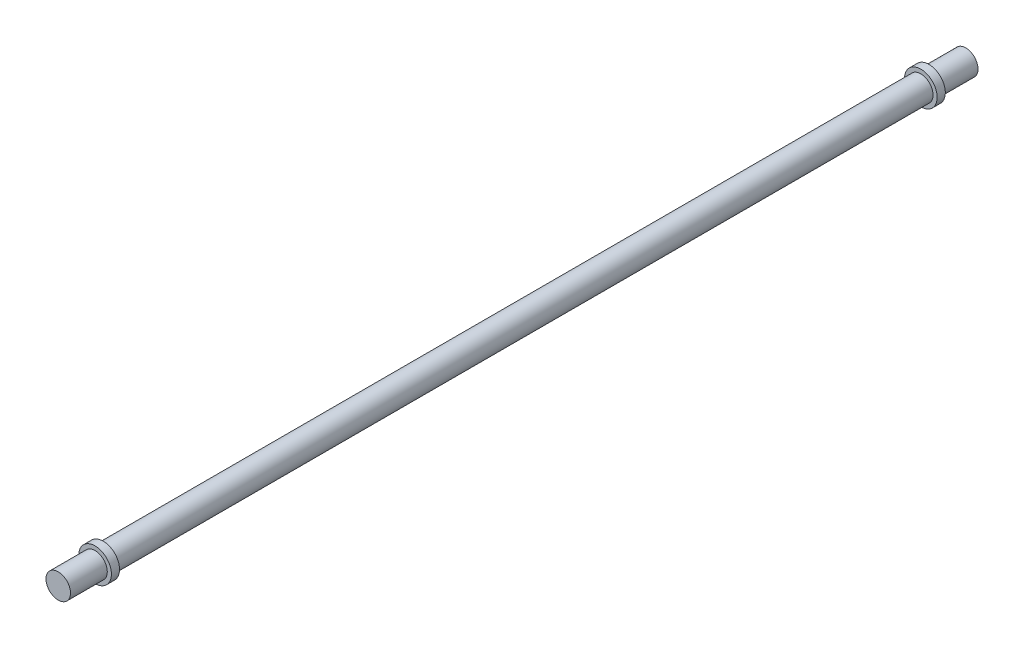
ISO-10303-21;
HEADER;
FILE_DESCRIPTION(('STEP AP214'),'2;1');
FILE_NAME('part.step','',(''),(''),'','','');
FILE_SCHEMA(('AUTOMOTIVE_DESIGN { 1 0 10303 214 1 1 1 1 }'));
ENDSEC;
DATA;
#1=APPLICATION_CONTEXT('core data for automotive mechanical design processes');
#2=APPLICATION_PROTOCOL_DEFINITION('international standard','automotive_design',2000,#1);
#3=PRODUCT_CONTEXT('',#1,'mechanical');
#4=PRODUCT('Part','Part','',(#3));
#5=PRODUCT_RELATED_PRODUCT_CATEGORY('part','',(#4));
#6=PRODUCT_DEFINITION_FORMATION('','',#4);
#7=PRODUCT_DEFINITION_CONTEXT('part definition',#1,'design');
#8=PRODUCT_DEFINITION('design','',#6,#7);
#9=PRODUCT_DEFINITION_SHAPE('','',#8);
#10=(LENGTH_UNIT() NAMED_UNIT(*) SI_UNIT(.MILLI.,.METRE.));
#11=(NAMED_UNIT(*) PLANE_ANGLE_UNIT() SI_UNIT($,.RADIAN.));
#12=(NAMED_UNIT(*) SI_UNIT($,.STERADIAN.) SOLID_ANGLE_UNIT());
#13=UNCERTAINTY_MEASURE_WITH_UNIT(LENGTH_MEASURE(1.E-05),#10,'distance_accuracy_value','');
#14=(GEOMETRIC_REPRESENTATION_CONTEXT(3) GLOBAL_UNCERTAINTY_ASSIGNED_CONTEXT((#13)) GLOBAL_UNIT_ASSIGNED_CONTEXT((#10,
#11,#12)) REPRESENTATION_CONTEXT('',''));
#15=CARTESIAN_POINT('',(0.,0.,0.));
#16=DIRECTION('',(0.,0.,1.));
#17=DIRECTION('',(1.,0.,0.));
#18=AXIS2_PLACEMENT_3D('',#15,#16,#17);
#19=CARTESIAN_POINT('',(0.,0.,1000.));
#20=DIRECTION('',(0.,0.,-1.));
#21=DIRECTION('',(-1.,0.,0.));
#22=AXIS2_PLACEMENT_3D('',#19,#20,#21);
#23=CYLINDRICAL_SURFACE('',#22,15.);
#24=CARTESIAN_POINT('',(0.,0.,1000.));
#25=DIRECTION('',(0.,0.,1.));
#26=DIRECTION('',(1.,0.,0.));
#27=AXIS2_PLACEMENT_3D('',#24,#25,#26);
#28=CIRCLE('',#27,15.);
#29=CARTESIAN_POINT('',(15.,0.,1000.));
#30=VERTEX_POINT('',#29);
#31=EDGE_CURVE('E10',#30,#30,#28,.T.);
#32=ORIENTED_EDGE('',*,*,#31,.F.);
#33=EDGE_LOOP('',(#32));
#34=FACE_BOUND('',#33,.T.);
#35=CARTESIAN_POINT('',(0.,0.,0.));
#36=DIRECTION('',(0.,0.,-1.));
#37=DIRECTION('',(-1.,0.,0.));
#38=AXIS2_PLACEMENT_3D('',#35,#36,#37);
#39=CIRCLE('',#38,15.);
#40=CARTESIAN_POINT('',(-15.,0.,0.));
#41=VERTEX_POINT('',#40);
#42=EDGE_CURVE('E59',#41,#41,#39,.T.);
#43=ORIENTED_EDGE('',*,*,#42,.F.);
#44=EDGE_LOOP('',(#43));
#45=FACE_BOUND('',#44,.T.);
#46=ADVANCED_FACE('F39',(#34,#45),#23,.T.);
#47=CARTESIAN_POINT('',(0.,0.,1010.));
#48=DIRECTION('',(0.,0.,-1.));
#49=DIRECTION('',(-1.,0.,0.));
#50=AXIS2_PLACEMENT_3D('',#47,#48,#49);
#51=CYLINDRICAL_SURFACE('',#50,20.);
#52=CARTESIAN_POINT('',(0.,0.,1010.));
#53=DIRECTION('',(0.,0.,1.));
#54=DIRECTION('',(1.,0.,0.));
#55=AXIS2_PLACEMENT_3D('',#52,#53,#54);
#56=CIRCLE('',#55,20.);
#57=CARTESIAN_POINT('',(20.,0.,1010.));
#58=VERTEX_POINT('',#57);
#59=EDGE_CURVE('E45',#58,#58,#56,.T.);
#60=ORIENTED_EDGE('',*,*,#59,.F.);
#61=EDGE_LOOP('',(#60));
#62=FACE_BOUND('',#61,.T.);
#63=CARTESIAN_POINT('',(0.,0.,1000.));
#64=DIRECTION('',(0.,0.,1.));
#65=DIRECTION('',(1.,0.,0.));
#66=AXIS2_PLACEMENT_3D('',#63,#64,#65);
#67=CIRCLE('',#66,20.);
#68=CARTESIAN_POINT('',(20.,0.,1000.));
#69=VERTEX_POINT('',#68);
#70=EDGE_CURVE('E49',#69,#69,#67,.T.);
#71=ORIENTED_EDGE('',*,*,#70,.T.);
#72=EDGE_LOOP('',(#71));
#73=FACE_BOUND('',#72,.T.);
#74=ADVANCED_FACE('F105',(#62,#73),#51,.T.);
#75=CARTESIAN_POINT('',(0.,0.,1010.));
#76=DIRECTION('',(0.,0.,1.));
#77=DIRECTION('',(1.,0.,0.));
#78=AXIS2_PLACEMENT_3D('',#75,#76,#77);
#79=PLANE('',#78);
#80=CARTESIAN_POINT('',(0.,0.,1010.));
#81=DIRECTION('',(0.,0.,1.));
#82=DIRECTION('',(1.,0.,0.));
#83=AXIS2_PLACEMENT_3D('',#80,#81,#82);
#84=CIRCLE('',#83,15.);
#85=CARTESIAN_POINT('',(15.,0.,1010.));
#86=VERTEX_POINT('',#85);
#87=EDGE_CURVE('E56',#86,#86,#84,.T.);
#88=ORIENTED_EDGE('',*,*,#87,.F.);
#89=EDGE_LOOP('',(#88));
#90=FACE_BOUND('',#89,.T.);
#91=ORIENTED_EDGE('',*,*,#59,.T.);
#92=EDGE_LOOP('',(#91));
#93=FACE_BOUND('',#92,.T.);
#94=ADVANCED_FACE('F110',(#90,#93),#79,.T.);
#95=CARTESIAN_POINT('',(0.,0.,1000.));
#96=DIRECTION('',(0.,0.,1.));
#97=DIRECTION('',(1.,0.,0.));
#98=AXIS2_PLACEMENT_3D('',#95,#96,#97);
#99=PLANE('',#98);
#100=ORIENTED_EDGE('',*,*,#31,.T.);
#101=EDGE_LOOP('',(#100));
#102=FACE_BOUND('',#101,.T.);
#103=ORIENTED_EDGE('',*,*,#70,.F.);
#104=EDGE_LOOP('',(#103));
#105=FACE_BOUND('',#104,.T.);
#106=ADVANCED_FACE('F118',(#102,#105),#99,.F.);
#107=CARTESIAN_POINT('',(0.,0.,1055.));
#108=DIRECTION('',(0.,0.,-1.));
#109=DIRECTION('',(-1.,0.,0.));
#110=AXIS2_PLACEMENT_3D('',#107,#108,#109);
#111=CYLINDRICAL_SURFACE('',#110,15.);
#112=CARTESIAN_POINT('',(0.,0.,1055.));
#113=DIRECTION('',(0.,0.,1.));
#114=DIRECTION('',(1.,0.,0.));
#115=AXIS2_PLACEMENT_3D('',#112,#113,#114);
#116=CIRCLE('',#115,15.);
#117=CARTESIAN_POINT('',(15.,0.,1055.));
#118=VERTEX_POINT('',#117);
#119=EDGE_CURVE('E54',#118,#118,#116,.T.);
#120=ORIENTED_EDGE('',*,*,#119,.F.);
#121=EDGE_LOOP('',(#120));
#122=FACE_BOUND('',#121,.T.);
#123=ORIENTED_EDGE('',*,*,#87,.T.);
#124=EDGE_LOOP('',(#123));
#125=FACE_BOUND('',#124,.T.);
#126=ADVANCED_FACE('F123',(#122,#125),#111,.T.);
#127=CARTESIAN_POINT('',(0.,0.,1055.));
#128=DIRECTION('',(0.,0.,1.));
#129=DIRECTION('',(1.,0.,0.));
#130=AXIS2_PLACEMENT_3D('',#127,#128,#129);
#131=PLANE('',#130);
#132=ORIENTED_EDGE('',*,*,#119,.T.);
#133=EDGE_LOOP('',(#132));
#134=FACE_BOUND('',#133,.T.);
#135=ADVANCED_FACE('F95',(#134),#131,.T.);
#136=CARTESIAN_POINT('',(0.,0.,-10.));
#137=DIRECTION('',(0.,0.,1.));
#138=DIRECTION('',(1.,0.,0.));
#139=AXIS2_PLACEMENT_3D('',#136,#137,#138);
#140=CYLINDRICAL_SURFACE('',#139,20.);
#141=CARTESIAN_POINT('',(0.,0.,-10.));
#142=DIRECTION('',(0.,0.,-1.));
#143=DIRECTION('',(-1.,0.,0.));
#144=AXIS2_PLACEMENT_3D('',#141,#142,#143);
#145=CIRCLE('',#144,20.);
#146=CARTESIAN_POINT('',(-20.,0.,-10.));
#147=VERTEX_POINT('',#146);
#148=EDGE_CURVE('E64',#147,#147,#145,.T.);
#149=ORIENTED_EDGE('',*,*,#148,.F.);
#150=EDGE_LOOP('',(#149));
#151=FACE_BOUND('',#150,.T.);
#152=CARTESIAN_POINT('',(0.,0.,0.));
#153=DIRECTION('',(0.,0.,-1.));
#154=DIRECTION('',(-1.,0.,0.));
#155=AXIS2_PLACEMENT_3D('',#152,#153,#154);
#156=CIRCLE('',#155,20.);
#157=CARTESIAN_POINT('',(-20.,0.,0.));
#158=VERTEX_POINT('',#157);
#159=EDGE_CURVE('E65',#158,#158,#156,.T.);
#160=ORIENTED_EDGE('',*,*,#159,.T.);
#161=EDGE_LOOP('',(#160));
#162=FACE_BOUND('',#161,.T.);
#163=ADVANCED_FACE('F89',(#151,#162),#140,.T.);
#164=CARTESIAN_POINT('',(0.,0.,-10.));
#165=DIRECTION('',(0.,0.,-1.));
#166=DIRECTION('',(-1.,0.,0.));
#167=AXIS2_PLACEMENT_3D('',#164,#165,#166);
#168=PLANE('',#167);
#169=CARTESIAN_POINT('',(0.,0.,-10.));
#170=DIRECTION('',(0.,0.,-1.));
#171=DIRECTION('',(-1.,0.,0.));
#172=AXIS2_PLACEMENT_3D('',#169,#170,#171);
#173=CIRCLE('',#172,15.);
#174=CARTESIAN_POINT('',(-15.,0.,-10.));
#175=VERTEX_POINT('',#174);
#176=EDGE_CURVE('E71',#175,#175,#173,.T.);
#177=ORIENTED_EDGE('',*,*,#176,.F.);
#178=EDGE_LOOP('',(#177));
#179=FACE_BOUND('',#178,.T.);
#180=ORIENTED_EDGE('',*,*,#148,.T.);
#181=EDGE_LOOP('',(#180));
#182=FACE_BOUND('',#181,.T.);
#183=ADVANCED_FACE('F86',(#179,#182),#168,.T.);
#184=CARTESIAN_POINT('',(0.,0.,0.));
#185=DIRECTION('',(0.,0.,-1.));
#186=DIRECTION('',(-1.,0.,0.));
#187=AXIS2_PLACEMENT_3D('',#184,#185,#186);
#188=PLANE('',#187);
#189=ORIENTED_EDGE('',*,*,#42,.T.);
#190=EDGE_LOOP('',(#189));
#191=FACE_BOUND('',#190,.T.);
#192=ORIENTED_EDGE('',*,*,#159,.F.);
#193=EDGE_LOOP('',(#192));
#194=FACE_BOUND('',#193,.T.);
#195=ADVANCED_FACE('F82',(#191,#194),#188,.F.);
#196=CARTESIAN_POINT('',(0.,0.,-55.));
#197=DIRECTION('',(0.,0.,1.));
#198=DIRECTION('',(1.,0.,0.));
#199=AXIS2_PLACEMENT_3D('',#196,#197,#198);
#200=CYLINDRICAL_SURFACE('',#199,15.);
#201=CARTESIAN_POINT('',(0.,0.,-55.));
#202=DIRECTION('',(0.,0.,-1.));
#203=DIRECTION('',(-1.,0.,0.));
#204=AXIS2_PLACEMENT_3D('',#201,#202,#203);
#205=CIRCLE('',#204,15.);
#206=CARTESIAN_POINT('',(-15.,0.,-55.));
#207=VERTEX_POINT('',#206);
#208=EDGE_CURVE('E68',#207,#207,#205,.T.);
#209=ORIENTED_EDGE('',*,*,#208,.F.);
#210=EDGE_LOOP('',(#209));
#211=FACE_BOUND('',#210,.T.);
#212=ORIENTED_EDGE('',*,*,#176,.T.);
#213=EDGE_LOOP('',(#212));
#214=FACE_BOUND('',#213,.T.);
#215=ADVANCED_FACE('F79',(#211,#214),#200,.T.);
#216=CARTESIAN_POINT('',(0.,0.,-55.));
#217=DIRECTION('',(0.,0.,-1.));
#218=DIRECTION('',(-1.,0.,0.));
#219=AXIS2_PLACEMENT_3D('',#216,#217,#218);
#220=PLANE('',#219);
#221=ORIENTED_EDGE('',*,*,#208,.T.);
#222=EDGE_LOOP('',(#221));
#223=FACE_BOUND('',#222,.T.);
#224=ADVANCED_FACE('F77',(#223),#220,.T.);
#225=CLOSED_SHELL('',(#46,#74,#94,#106,#126,#135,#163,#183,#195,#215,#224));
#226=MANIFOLD_SOLID_BREP('B2',#225);
#227=ADVANCED_BREP_SHAPE_REPRESENTATION('',(#18,#226),#14);
#228=SHAPE_DEFINITION_REPRESENTATION(#9,#227);
ENDSEC;
END-ISO-10303-21;
